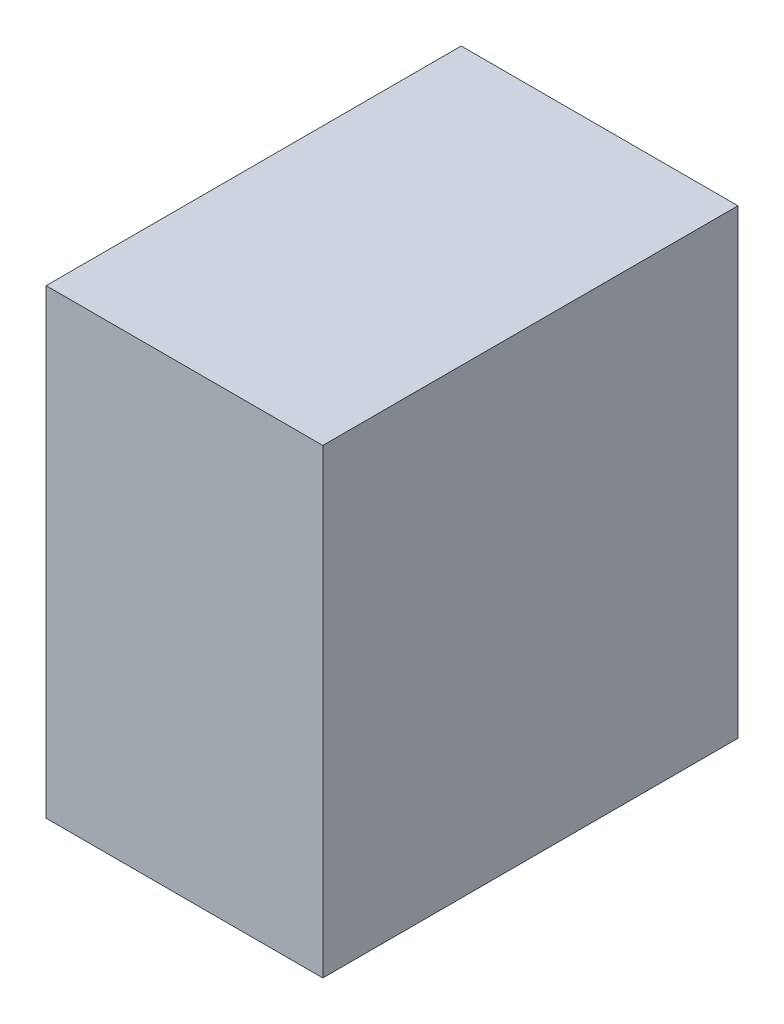
ISO-10303-21;
HEADER;
FILE_DESCRIPTION(('STEP AP214'),'2;1');
FILE_NAME('part.step','',(''),(''),'','','');
FILE_SCHEMA(('AUTOMOTIVE_DESIGN { 1 0 10303 214 1 1 1 1 }'));
ENDSEC;
DATA;
#1=APPLICATION_CONTEXT('core data for automotive mechanical design processes');
#2=APPLICATION_PROTOCOL_DEFINITION('international standard','automotive_design',2000,#1);
#3=PRODUCT_CONTEXT('',#1,'mechanical');
#4=PRODUCT('Part','Part','',(#3));
#5=PRODUCT_RELATED_PRODUCT_CATEGORY('part','',(#4));
#6=PRODUCT_DEFINITION_FORMATION('','',#4);
#7=PRODUCT_DEFINITION_CONTEXT('part definition',#1,'design');
#8=PRODUCT_DEFINITION('design','',#6,#7);
#9=PRODUCT_DEFINITION_SHAPE('','',#8);
#10=(LENGTH_UNIT() NAMED_UNIT(*) SI_UNIT(.MILLI.,.METRE.));
#11=(NAMED_UNIT(*) PLANE_ANGLE_UNIT() SI_UNIT($,.RADIAN.));
#12=(NAMED_UNIT(*) SI_UNIT($,.STERADIAN.) SOLID_ANGLE_UNIT());
#13=UNCERTAINTY_MEASURE_WITH_UNIT(LENGTH_MEASURE(1.E-05),#10,'distance_accuracy_value','');
#14=(GEOMETRIC_REPRESENTATION_CONTEXT(3) GLOBAL_UNCERTAINTY_ASSIGNED_CONTEXT((#13)) GLOBAL_UNIT_ASSIGNED_CONTEXT((#10,
#11,#12)) REPRESENTATION_CONTEXT('',''));
#15=CARTESIAN_POINT('',(0.,0.,0.));
#16=DIRECTION('',(0.,0.,1.));
#17=DIRECTION('',(1.,0.,0.));
#18=AXIS2_PLACEMENT_3D('',#15,#16,#17);
#19=CARTESIAN_POINT('',(-3.29999987760809,0.700000791174128,-3.30112158219206));
#20=DIRECTION('',(1.,-1.74845553146952E-07,0.));
#21=DIRECTION('',(1.74845553146952E-07,1.,-8.74227765734759E-08));
#22=AXIS2_PLACEMENT_3D('',#19,#20,#21);
#23=PLANE('',#22);
#24=DIRECTION('',(0.,-8.7422776672162E-08,-0.999999999999996));
#25=VECTOR('',#24,1.);
#26=CARTESIAN_POINT('',(-3.29999986886581,0.750000874225766,-2.3511215865632));
#27=LINE('',#26,#25);
#28=CARTESIAN_POINT('',(-3.29999986886681,0.750000874225766,-2.3511215865642));
#29=VERTEX_POINT('',#28);
#30=CARTESIAN_POINT('',(-3.29999986886682,0.750000795546267,-3.2511215865632));
#31=VERTEX_POINT('',#30);
#32=EDGE_CURVE('E11',#29,#31,#27,.T.);
#33=ORIENTED_EDGE('',*,*,#32,.T.);
#34=DIRECTION('',(1.74845553146599E-07,0.999999999999981,-8.74227765732993E-08));
#35=VECTOR('',#34,1.);
#36=CARTESIAN_POINT('',(-3.29999986886582,0.750000795545267,-3.2511215865632));
#37=LINE('',#36,#35);
#38=CARTESIAN_POINT('',(-3.29999969402126,1.75000079554727,-3.25112167398498));
#39=VERTEX_POINT('',#38);
#40=EDGE_CURVE('E69',#31,#39,#37,.T.);
#41=ORIENTED_EDGE('',*,*,#40,.T.);
#42=DIRECTION('',(0.,8.7422776672162E-08,0.999999999999996));
#43=VECTOR('',#42,1.);
#44=CARTESIAN_POINT('',(-3.29999969402026,1.75000079554727,-3.25112167398598));
#45=LINE('',#44,#43);
#46=CARTESIAN_POINT('',(-3.29999969402126,1.75000087422677,-2.35112167398598));
#47=VERTEX_POINT('',#46);
#48=EDGE_CURVE('E55',#39,#47,#45,.T.);
#49=ORIENTED_EDGE('',*,*,#48,.T.);
#50=DIRECTION('',(-1.74845553146599E-07,-0.999999999999981,8.74227765732993E-08));
#51=VECTOR('',#50,1.);
#52=CARTESIAN_POINT('',(-3.29999969402026,1.75000087422777,-2.35112167398598));
#53=LINE('',#52,#51);
#54=EDGE_CURVE('E53',#47,#29,#53,.T.);
#55=ORIENTED_EDGE('',*,*,#54,.T.);
#56=EDGE_LOOP('',(#33,#41,#49,#55));
#57=FACE_BOUND('',#56,.T.);
#58=ADVANCED_FACE('F17',(#57),#23,.T.);
#59=CARTESIAN_POINT('',(-3.89999987760809,0.70000089608146,-3.30112158219207));
#60=DIRECTION('',(1.,-1.74845553146952E-07,0.));
#61=DIRECTION('',(1.74845553146952E-07,1.,-8.74227765734759E-08));
#62=AXIS2_PLACEMENT_3D('',#59,#60,#61);
#63=PLANE('',#62);
#64=DIRECTION('',(-1.74845553146599E-07,-0.999999999999981,8.74227765732993E-08));
#65=VECTOR('',#64,1.);
#66=CARTESIAN_POINT('',(-3.89999969402026,1.7500009791351,-2.35112167398598));
#67=LINE('',#66,#65);
#68=CARTESIAN_POINT('',(-3.89999969401926,1.7500009791341,-2.35112167398598));
#69=VERTEX_POINT('',#68);
#70=CARTESIAN_POINT('',(-3.89999986886481,0.750000979133098,-2.35112158656421));
#71=VERTEX_POINT('',#70);
#72=EDGE_CURVE('E24',#69,#71,#67,.T.);
#73=ORIENTED_EDGE('',*,*,#72,.F.);
#74=DIRECTION('',(0.,8.74227766721621E-08,0.999999999999996));
#75=VECTOR('',#74,1.);
#76=CARTESIAN_POINT('',(-3.89999969402026,1.7500009004546,-3.25112167398598));
#77=LINE('',#76,#75);
#78=CARTESIAN_POINT('',(-3.89999969401926,1.7500009004546,-3.25112167398498));
#79=VERTEX_POINT('',#78);
#80=EDGE_CURVE('E70',#79,#69,#77,.T.);
#81=ORIENTED_EDGE('',*,*,#80,.F.);
#82=DIRECTION('',(1.74845553146599E-07,0.999999999999981,-8.74227765732993E-08));
#83=VECTOR('',#82,1.);
#84=CARTESIAN_POINT('',(-3.89999986886582,0.750000900452599,-3.25112158656321));
#85=LINE('',#84,#83);
#86=CARTESIAN_POINT('',(-3.89999986886482,0.750000900453599,-3.25112158656321));
#87=VERTEX_POINT('',#86);
#88=EDGE_CURVE('E59',#87,#79,#85,.T.);
#89=ORIENTED_EDGE('',*,*,#88,.F.);
#90=DIRECTION('',(0.,-8.7422776548804E-08,-0.999999999999996));
#91=VECTOR('',#90,1.);
#92=CARTESIAN_POINT('',(-3.89999986886581,0.750000979133098,-2.35112158656321));
#93=LINE('',#92,#91);
#94=EDGE_CURVE('E78',#71,#87,#93,.T.);
#95=ORIENTED_EDGE('',*,*,#94,.F.);
#96=EDGE_LOOP('',(#73,#81,#89,#95));
#97=FACE_BOUND('',#96,.T.);
#98=ADVANCED_FACE('F89',(#97),#63,.F.);
#99=CARTESIAN_POINT('',(-3.29999986886581,0.750000874225766,-2.3511215865632));
#100=DIRECTION('',(1.74845553146952E-07,1.,-8.74227765734759E-08));
#101=DIRECTION('',(0.,-8.74227765734759E-08,-1.));
#102=AXIS2_PLACEMENT_3D('',#99,#100,#101);
#103=PLANE('',#102);
#104=DIRECTION('',(-0.999999999999985,1.74845553220964E-07,0.));
#105=VECTOR('',#104,1.);
#106=CARTESIAN_POINT('',(-3.29999986886581,0.750000874225766,-2.3511215865632));
#107=LINE('',#106,#105);
#108=EDGE_CURVE('E65',#29,#71,#107,.T.);
#109=ORIENTED_EDGE('',*,*,#108,.T.);
#110=ORIENTED_EDGE('',*,*,#94,.T.);
#111=DIRECTION('',(-0.999999999999985,1.74845553220964E-07,0.));
#112=VECTOR('',#111,1.);
#113=CARTESIAN_POINT('',(-3.29999986886582,0.750000795545267,-3.2511215865632));
#114=LINE('',#113,#112);
#115=EDGE_CURVE('E66',#31,#87,#114,.T.);
#116=ORIENTED_EDGE('',*,*,#115,.F.);
#117=ORIENTED_EDGE('',*,*,#32,.F.);
#118=EDGE_LOOP('',(#109,#110,#116,#117));
#119=FACE_BOUND('',#118,.T.);
#120=ADVANCED_FACE('F63',(#119),#103,.F.);
#121=CARTESIAN_POINT('',(-3.29999986886582,0.750000795545267,-3.2511215865632));
#122=DIRECTION('',(0.,8.74227765734759E-08,1.));
#123=DIRECTION('',(1.74845553146952E-07,1.,-8.74227765734759E-08));
#124=AXIS2_PLACEMENT_3D('',#121,#122,#123);
#125=PLANE('',#124);
#126=ORIENTED_EDGE('',*,*,#115,.T.);
#127=ORIENTED_EDGE('',*,*,#88,.T.);
#128=DIRECTION('',(-0.999999999999985,1.74845553220964E-07,0.));
#129=VECTOR('',#128,1.);
#130=CARTESIAN_POINT('',(-3.29999969402026,1.75000079554727,-3.25112167398598));
#131=LINE('',#130,#129);
#132=EDGE_CURVE('E60',#39,#79,#131,.T.);
#133=ORIENTED_EDGE('',*,*,#132,.F.);
#134=ORIENTED_EDGE('',*,*,#40,.F.);
#135=EDGE_LOOP('',(#126,#127,#133,#134));
#136=FACE_BOUND('',#135,.T.);
#137=ADVANCED_FACE('F91',(#136),#125,.F.);
#138=CARTESIAN_POINT('',(-3.29999969402026,1.75000079554727,-3.25112167398598));
#139=DIRECTION('',(-1.74845553146952E-07,-1.,8.74227765734759E-08));
#140=DIRECTION('',(0.,8.74227765734759E-08,1.));
#141=AXIS2_PLACEMENT_3D('',#138,#139,#140);
#142=PLANE('',#141);
#143=ORIENTED_EDGE('',*,*,#132,.T.);
#144=ORIENTED_EDGE('',*,*,#80,.T.);
#145=DIRECTION('',(-0.999999999999985,1.74845553220964E-07,0.));
#146=VECTOR('',#145,1.);
#147=CARTESIAN_POINT('',(-3.29999969402026,1.75000087422777,-2.35112167398598));
#148=LINE('',#147,#146);
#149=EDGE_CURVE('E84',#47,#69,#148,.T.);
#150=ORIENTED_EDGE('',*,*,#149,.F.);
#151=ORIENTED_EDGE('',*,*,#48,.F.);
#152=EDGE_LOOP('',(#143,#144,#150,#151));
#153=FACE_BOUND('',#152,.T.);
#154=ADVANCED_FACE('F86',(#153),#142,.F.);
#155=CARTESIAN_POINT('',(-3.29999969402026,1.75000087422777,-2.35112167398598));
#156=DIRECTION('',(0.,-8.74227765734759E-08,-1.));
#157=DIRECTION('',(-1.74845553146952E-07,-1.,8.74227765734759E-08));
#158=AXIS2_PLACEMENT_3D('',#155,#156,#157);
#159=PLANE('',#158);
#160=ORIENTED_EDGE('',*,*,#149,.T.);
#161=ORIENTED_EDGE('',*,*,#72,.T.);
#162=ORIENTED_EDGE('',*,*,#108,.F.);
#163=ORIENTED_EDGE('',*,*,#54,.F.);
#164=EDGE_LOOP('',(#160,#161,#162,#163));
#165=FACE_BOUND('',#164,.T.);
#166=ADVANCED_FACE('F68',(#165),#159,.F.);
#167=CLOSED_SHELL('',(#58,#98,#120,#137,#154,#166));
#168=MANIFOLD_SOLID_BREP('B1',#167);
#169=ADVANCED_BREP_SHAPE_REPRESENTATION('',(#18,#168),#14);
#170=SHAPE_DEFINITION_REPRESENTATION(#9,#169);
ENDSEC;
END-ISO-10303-21;
